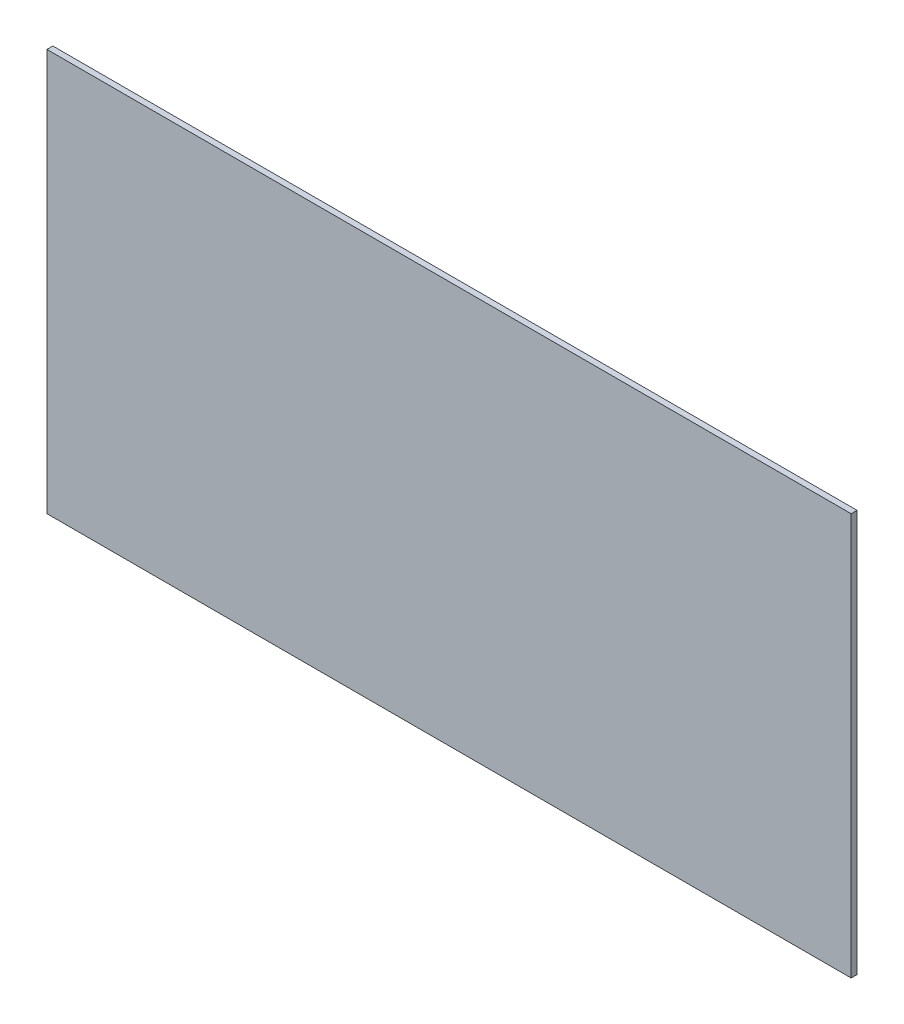
ISO-10303-21;
HEADER;
FILE_DESCRIPTION(('STEP AP214'),'2;1');
FILE_NAME('part.step','',(''),(''),'','','');
FILE_SCHEMA(('AUTOMOTIVE_DESIGN { 1 0 10303 214 1 1 1 1 }'));
ENDSEC;
DATA;
#1=APPLICATION_CONTEXT('core data for automotive mechanical design processes');
#2=APPLICATION_PROTOCOL_DEFINITION('international standard','automotive_design',2000,#1);
#3=PRODUCT_CONTEXT('',#1,'mechanical');
#4=PRODUCT('Part','Part','',(#3));
#5=PRODUCT_RELATED_PRODUCT_CATEGORY('part','',(#4));
#6=PRODUCT_DEFINITION_FORMATION('','',#4);
#7=PRODUCT_DEFINITION_CONTEXT('part definition',#1,'design');
#8=PRODUCT_DEFINITION('design','',#6,#7);
#9=PRODUCT_DEFINITION_SHAPE('','',#8);
#10=(LENGTH_UNIT() NAMED_UNIT(*) SI_UNIT(.MILLI.,.METRE.));
#11=(NAMED_UNIT(*) PLANE_ANGLE_UNIT() SI_UNIT($,.RADIAN.));
#12=(NAMED_UNIT(*) SI_UNIT($,.STERADIAN.) SOLID_ANGLE_UNIT());
#13=UNCERTAINTY_MEASURE_WITH_UNIT(LENGTH_MEASURE(1.E-05),#10,'distance_accuracy_value','');
#14=(GEOMETRIC_REPRESENTATION_CONTEXT(3) GLOBAL_UNCERTAINTY_ASSIGNED_CONTEXT((#13)) GLOBAL_UNIT_ASSIGNED_CONTEXT((#10,
#11,#12)) REPRESENTATION_CONTEXT('',''));
#15=CARTESIAN_POINT('',(0.,0.,0.));
#16=DIRECTION('',(0.,0.,1.));
#17=DIRECTION('',(1.,0.,0.));
#18=AXIS2_PLACEMENT_3D('',#15,#16,#17);
#19=CARTESIAN_POINT('',(0.,0.,6.35));
#20=DIRECTION('',(1.,0.,0.));
#21=DIRECTION('',(0.,0.,-1.));
#22=AXIS2_PLACEMENT_3D('',#19,#20,#21);
#23=PLANE('',#22);
#24=DIRECTION('',(0.,-1.,0.));
#25=VECTOR('',#24,1.);
#26=CARTESIAN_POINT('',(0.,0.,0.));
#27=LINE('',#26,#25);
#28=CARTESIAN_POINT('',(0.,431.8,0.));
#29=VERTEX_POINT('',#28);
#30=CARTESIAN_POINT('',(0.,0.,0.));
#31=VERTEX_POINT('',#30);
#32=EDGE_CURVE('E96',#29,#31,#27,.T.);
#33=ORIENTED_EDGE('',*,*,#32,.T.);
#34=DIRECTION('',(0.,0.,-1.));
#35=VECTOR('',#34,1.);
#36=CARTESIAN_POINT('',(0.,0.,6.35));
#37=LINE('',#36,#35);
#38=CARTESIAN_POINT('',(0.,0.,6.35));
#39=VERTEX_POINT('',#38);
#40=EDGE_CURVE('E11',#39,#31,#37,.T.);
#41=ORIENTED_EDGE('',*,*,#40,.F.);
#42=DIRECTION('',(0.,-1.,0.));
#43=VECTOR('',#42,1.);
#44=CARTESIAN_POINT('',(0.,0.,6.35));
#45=LINE('',#44,#43);
#46=CARTESIAN_POINT('',(0.,431.8,6.35));
#47=VERTEX_POINT('',#46);
#48=EDGE_CURVE('E84',#47,#39,#45,.T.);
#49=ORIENTED_EDGE('',*,*,#48,.F.);
#50=DIRECTION('',(0.,0.,-1.));
#51=VECTOR('',#50,1.);
#52=CARTESIAN_POINT('',(0.,431.8,6.35));
#53=LINE('',#52,#51);
#54=EDGE_CURVE('E92',#47,#29,#53,.T.);
#55=ORIENTED_EDGE('',*,*,#54,.T.);
#56=EDGE_LOOP('',(#33,#41,#49,#55));
#57=FACE_BOUND('',#56,.T.);
#58=ADVANCED_FACE('F33',(#57),#23,.F.);
#59=CARTESIAN_POINT('',(0.,0.,6.35));
#60=DIRECTION('',(0.,1.,0.));
#61=DIRECTION('',(0.,0.,1.));
#62=AXIS2_PLACEMENT_3D('',#59,#60,#61);
#63=PLANE('',#62);
#64=DIRECTION('',(1.,0.,0.));
#65=VECTOR('',#64,1.);
#66=CARTESIAN_POINT('',(0.,0.,0.));
#67=LINE('',#66,#65);
#68=CARTESIAN_POINT('',(863.6,0.,0.));
#69=VERTEX_POINT('',#68);
#70=EDGE_CURVE('E88',#31,#69,#67,.T.);
#71=ORIENTED_EDGE('',*,*,#70,.T.);
#72=DIRECTION('',(0.,0.,-1.));
#73=VECTOR('',#72,1.);
#74=CARTESIAN_POINT('',(863.6,0.,6.35));
#75=LINE('',#74,#73);
#76=CARTESIAN_POINT('',(863.6,0.,6.35));
#77=VERTEX_POINT('',#76);
#78=EDGE_CURVE('E41',#77,#69,#75,.T.);
#79=ORIENTED_EDGE('',*,*,#78,.F.);
#80=DIRECTION('',(1.,0.,0.));
#81=VECTOR('',#80,1.);
#82=CARTESIAN_POINT('',(0.,0.,6.35));
#83=LINE('',#82,#81);
#84=EDGE_CURVE('E79',#39,#77,#83,.T.);
#85=ORIENTED_EDGE('',*,*,#84,.F.);
#86=ORIENTED_EDGE('',*,*,#40,.T.);
#87=EDGE_LOOP('',(#71,#79,#85,#86));
#88=FACE_BOUND('',#87,.T.);
#89=ADVANCED_FACE('F87',(#88),#63,.F.);
#90=CARTESIAN_POINT('',(863.6,0.,6.35));
#91=DIRECTION('',(-1.,0.,0.));
#92=DIRECTION('',(0.,0.,1.));
#93=AXIS2_PLACEMENT_3D('',#90,#91,#92);
#94=PLANE('',#93);
#95=DIRECTION('',(0.,1.,0.));
#96=VECTOR('',#95,1.);
#97=CARTESIAN_POINT('',(863.6,0.,0.));
#98=LINE('',#97,#96);
#99=CARTESIAN_POINT('',(863.6,431.8,0.));
#100=VERTEX_POINT('',#99);
#101=EDGE_CURVE('E66',#69,#100,#98,.T.);
#102=ORIENTED_EDGE('',*,*,#101,.T.);
#103=DIRECTION('',(0.,0.,-1.));
#104=VECTOR('',#103,1.);
#105=CARTESIAN_POINT('',(863.6,431.8,6.35));
#106=LINE('',#105,#104);
#107=CARTESIAN_POINT('',(863.6,431.8,6.35));
#108=VERTEX_POINT('',#107);
#109=EDGE_CURVE('E89',#108,#100,#106,.T.);
#110=ORIENTED_EDGE('',*,*,#109,.F.);
#111=DIRECTION('',(0.,1.,0.));
#112=VECTOR('',#111,1.);
#113=CARTESIAN_POINT('',(863.6,0.,6.35));
#114=LINE('',#113,#112);
#115=EDGE_CURVE('E82',#77,#108,#114,.T.);
#116=ORIENTED_EDGE('',*,*,#115,.F.);
#117=ORIENTED_EDGE('',*,*,#78,.T.);
#118=EDGE_LOOP('',(#102,#110,#116,#117));
#119=FACE_BOUND('',#118,.T.);
#120=ADVANCED_FACE('F90',(#119),#94,.F.);
#121=CARTESIAN_POINT('',(0.,431.8,6.35));
#122=DIRECTION('',(0.,-1.,0.));
#123=DIRECTION('',(0.,0.,-1.));
#124=AXIS2_PLACEMENT_3D('',#121,#122,#123);
#125=PLANE('',#124);
#126=DIRECTION('',(-1.,0.,0.));
#127=VECTOR('',#126,1.);
#128=CARTESIAN_POINT('',(0.,431.8,0.));
#129=LINE('',#128,#127);
#130=EDGE_CURVE('E72',#100,#29,#129,.T.);
#131=ORIENTED_EDGE('',*,*,#130,.T.);
#132=ORIENTED_EDGE('',*,*,#54,.F.);
#133=DIRECTION('',(-1.,0.,0.));
#134=VECTOR('',#133,1.);
#135=CARTESIAN_POINT('',(0.,431.8,6.35));
#136=LINE('',#135,#134);
#137=EDGE_CURVE('E49',#108,#47,#136,.T.);
#138=ORIENTED_EDGE('',*,*,#137,.F.);
#139=ORIENTED_EDGE('',*,*,#109,.T.);
#140=EDGE_LOOP('',(#131,#132,#138,#139));
#141=FACE_BOUND('',#140,.T.);
#142=ADVANCED_FACE('F103',(#141),#125,.F.);
#143=CARTESIAN_POINT('',(0.,0.,6.35));
#144=DIRECTION('',(0.,0.,-1.));
#145=DIRECTION('',(-1.,0.,0.));
#146=AXIS2_PLACEMENT_3D('',#143,#144,#145);
#147=PLANE('',#146);
#148=ORIENTED_EDGE('',*,*,#48,.T.);
#149=ORIENTED_EDGE('',*,*,#84,.T.);
#150=ORIENTED_EDGE('',*,*,#115,.T.);
#151=ORIENTED_EDGE('',*,*,#137,.T.);
#152=EDGE_LOOP('',(#148,#149,#150,#151));
#153=FACE_BOUND('',#152,.T.);
#154=ADVANCED_FACE('F80',(#153),#147,.F.);
#155=CARTESIAN_POINT('',(0.,0.,0.));
#156=DIRECTION('',(0.,0.,-1.));
#157=DIRECTION('',(-1.,0.,0.));
#158=AXIS2_PLACEMENT_3D('',#155,#156,#157);
#159=PLANE('',#158);
#160=ORIENTED_EDGE('',*,*,#32,.F.);
#161=ORIENTED_EDGE('',*,*,#130,.F.);
#162=ORIENTED_EDGE('',*,*,#101,.F.);
#163=ORIENTED_EDGE('',*,*,#70,.F.);
#164=EDGE_LOOP('',(#160,#161,#162,#163));
#165=FACE_BOUND('',#164,.T.);
#166=ADVANCED_FACE('F106',(#165),#159,.T.);
#167=CLOSED_SHELL('',(#58,#89,#120,#142,#154,#166));
#168=MANIFOLD_SOLID_BREP('B2',#167);
#169=ADVANCED_BREP_SHAPE_REPRESENTATION('',(#18,#168),#14);
#170=SHAPE_DEFINITION_REPRESENTATION(#9,#169);
ENDSEC;
END-ISO-10303-21;
